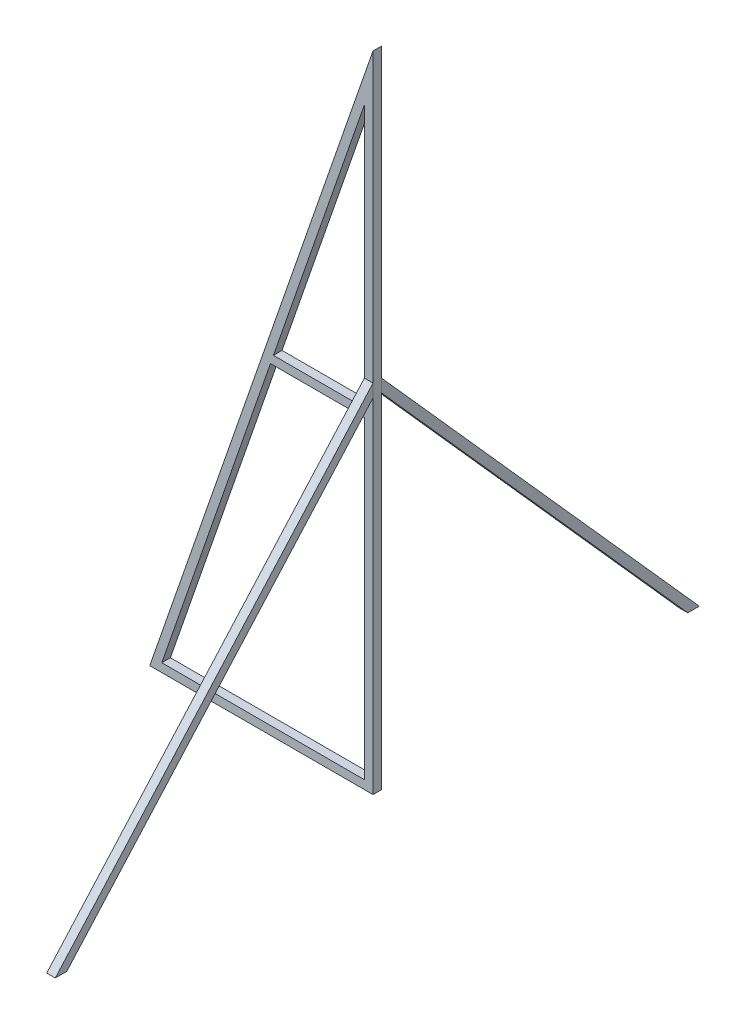
ISO-10303-21;
HEADER;
FILE_DESCRIPTION(('STEP AP214'),'2;1');
FILE_NAME('part.step','',(''),(''),'','','');
FILE_SCHEMA(('AUTOMOTIVE_DESIGN { 1 0 10303 214 1 1 1 1 }'));
ENDSEC;
DATA;
#1=APPLICATION_CONTEXT('core data for automotive mechanical design processes');
#2=APPLICATION_PROTOCOL_DEFINITION('international standard','automotive_design',2000,#1);
#3=PRODUCT_CONTEXT('',#1,'mechanical');
#4=PRODUCT('Part','Part','',(#3));
#5=PRODUCT_RELATED_PRODUCT_CATEGORY('part','',(#4));
#6=PRODUCT_DEFINITION_FORMATION('','',#4);
#7=PRODUCT_DEFINITION_CONTEXT('part definition',#1,'design');
#8=PRODUCT_DEFINITION('design','',#6,#7);
#9=PRODUCT_DEFINITION_SHAPE('','',#8);
#10=(LENGTH_UNIT() NAMED_UNIT(*) SI_UNIT(.MILLI.,.METRE.));
#11=(NAMED_UNIT(*) PLANE_ANGLE_UNIT() SI_UNIT($,.RADIAN.));
#12=(NAMED_UNIT(*) SI_UNIT($,.STERADIAN.) SOLID_ANGLE_UNIT());
#13=UNCERTAINTY_MEASURE_WITH_UNIT(LENGTH_MEASURE(1.E-05),#10,'distance_accuracy_value','');
#14=(GEOMETRIC_REPRESENTATION_CONTEXT(3) GLOBAL_UNCERTAINTY_ASSIGNED_CONTEXT((#13)) GLOBAL_UNIT_ASSIGNED_CONTEXT((#10,
#11,#12)) REPRESENTATION_CONTEXT('',''));
#15=CARTESIAN_POINT('',(0.,0.,0.));
#16=DIRECTION('',(0.,0.,1.));
#17=DIRECTION('',(1.,0.,0.));
#18=AXIS2_PLACEMENT_3D('',#15,#16,#17);
#19=CARTESIAN_POINT('',(50.,83.0054621254937,0.));
#20=DIRECTION('',(0.,0.665455066971264,-0.746437910239204));
#21=DIRECTION('',(0.,0.746437910239204,0.665455066971264));
#22=AXIS2_PLACEMENT_3D('',#19,#20,#21);
#23=PLANE('',#22);
#24=DIRECTION('',(0.,0.746437910239204,0.665455066971264));
#25=VECTOR('',#24,1.);
#26=CARTESIAN_POINT('',(52.,83.0054621254937,0.));
#27=LINE('',#26,#25);
#28=CARTESIAN_POINT('',(52.,0.,-74.));
#29=VERTEX_POINT('',#28);
#30=CARTESIAN_POINT('',(52.,83.0054621254937,0.));
#31=VERTEX_POINT('',#30);
#32=EDGE_CURVE('E113',#29,#31,#27,.T.);
#33=ORIENTED_EDGE('',*,*,#32,.F.);
#34=DIRECTION('',(1.,0.,0.));
#35=VECTOR('',#34,1.);
#36=CARTESIAN_POINT('',(50.,0.,-74.));
#37=LINE('',#36,#35);
#38=CARTESIAN_POINT('',(50.,0.,-74.));
#39=VERTEX_POINT('',#38);
#40=EDGE_CURVE('E12',#39,#29,#37,.T.);
#41=ORIENTED_EDGE('',*,*,#40,.F.);
#42=DIRECTION('',(0.,0.746437910239204,0.665455066971264));
#43=VECTOR('',#42,1.);
#44=CARTESIAN_POINT('',(50.,83.0054621254937,0.));
#45=LINE('',#44,#43);
#46=CARTESIAN_POINT('',(50.,83.0054621254937,0.));
#47=VERTEX_POINT('',#46);
#48=EDGE_CURVE('E107',#39,#47,#45,.T.);
#49=ORIENTED_EDGE('',*,*,#48,.T.);
#50=DIRECTION('',(1.,0.,0.));
#51=VECTOR('',#50,1.);
#52=CARTESIAN_POINT('',(50.,83.0054621254937,0.));
#53=LINE('',#52,#51);
#54=EDGE_CURVE('E52',#47,#31,#53,.T.);
#55=ORIENTED_EDGE('',*,*,#54,.T.);
#56=EDGE_LOOP('',(#33,#41,#49,#55));
#57=FACE_BOUND('',#56,.T.);
#58=ADVANCED_FACE('F49',(#57),#23,.T.);
#59=CARTESIAN_POINT('',(50.,0.,-74.));
#60=DIRECTION('',(0.,-1.,0.));
#61=DIRECTION('',(0.,0.,-1.));
#62=AXIS2_PLACEMENT_3D('',#59,#60,#61);
#63=PLANE('',#62);
#64=DIRECTION('',(0.,0.,-1.));
#65=VECTOR('',#64,1.);
#66=CARTESIAN_POINT('',(52.,0.,-74.));
#67=LINE('',#66,#65);
#68=CARTESIAN_POINT('',(52.,0.,-71.3206076854281));
#69=VERTEX_POINT('',#68);
#70=EDGE_CURVE('E109',#69,#29,#67,.T.);
#71=ORIENTED_EDGE('',*,*,#70,.F.);
#72=DIRECTION('',(1.,0.,0.));
#73=VECTOR('',#72,1.);
#74=CARTESIAN_POINT('',(50.,0.,-71.3206076854281));
#75=LINE('',#74,#73);
#76=CARTESIAN_POINT('',(50.,0.,-71.3206076854281));
#77=VERTEX_POINT('',#76);
#78=EDGE_CURVE('E58',#77,#69,#75,.T.);
#79=ORIENTED_EDGE('',*,*,#78,.F.);
#80=DIRECTION('',(0.,0.,-1.));
#81=VECTOR('',#80,1.);
#82=CARTESIAN_POINT('',(50.,0.,-74.));
#83=LINE('',#82,#81);
#84=EDGE_CURVE('E104',#77,#39,#83,.T.);
#85=ORIENTED_EDGE('',*,*,#84,.T.);
#86=ORIENTED_EDGE('',*,*,#40,.T.);
#87=EDGE_LOOP('',(#71,#79,#85,#86));
#88=FACE_BOUND('',#87,.T.);
#89=ADVANCED_FACE('F123',(#88),#63,.T.);
#90=CARTESIAN_POINT('',(50.,0.,-71.3206076854281));
#91=DIRECTION('',(0.,-0.665455066971264,0.746437910239204));
#92=DIRECTION('',(0.,-0.746437910239204,-0.665455066971264));
#93=AXIS2_PLACEMENT_3D('',#90,#91,#92);
#94=PLANE('',#93);
#95=DIRECTION('',(0.,-0.746437910239204,-0.665455066971264));
#96=VECTOR('',#95,1.);
#97=CARTESIAN_POINT('',(52.,0.,-71.3206076854281));
#98=LINE('',#97,#96);
#99=CARTESIAN_POINT('',(52.,80.,0.));
#100=VERTEX_POINT('',#99);
#101=EDGE_CURVE('E99',#100,#69,#98,.T.);
#102=ORIENTED_EDGE('',*,*,#101,.F.);
#103=DIRECTION('',(1.,0.,0.));
#104=VECTOR('',#103,1.);
#105=CARTESIAN_POINT('',(50.,80.,0.));
#106=LINE('',#105,#104);
#107=CARTESIAN_POINT('',(50.,80.,0.));
#108=VERTEX_POINT('',#107);
#109=EDGE_CURVE('E94',#108,#100,#106,.T.);
#110=ORIENTED_EDGE('',*,*,#109,.F.);
#111=DIRECTION('',(0.,-0.746437910239204,-0.665455066971264));
#112=VECTOR('',#111,1.);
#113=CARTESIAN_POINT('',(50.,0.,-71.3206076854281));
#114=LINE('',#113,#112);
#115=EDGE_CURVE('E97',#108,#77,#114,.T.);
#116=ORIENTED_EDGE('',*,*,#115,.T.);
#117=ORIENTED_EDGE('',*,*,#78,.T.);
#118=EDGE_LOOP('',(#102,#110,#116,#117));
#119=FACE_BOUND('',#118,.T.);
#120=ADVANCED_FACE('F96',(#119),#94,.T.);
#121=CARTESIAN_POINT('',(50.,80.,0.));
#122=DIRECTION('',(0.,0.,1.));
#123=DIRECTION('',(0.,-1.,0.));
#124=AXIS2_PLACEMENT_3D('',#121,#122,#123);
#125=PLANE('',#124);
#126=DIRECTION('',(0.,-1.,0.));
#127=VECTOR('',#126,1.);
#128=CARTESIAN_POINT('',(52.,80.,0.));
#129=LINE('',#128,#127);
#130=EDGE_CURVE('E116',#31,#100,#129,.T.);
#131=ORIENTED_EDGE('',*,*,#130,.F.);
#132=ORIENTED_EDGE('',*,*,#54,.F.);
#133=DIRECTION('',(0.,-1.,0.));
#134=VECTOR('',#133,1.);
#135=CARTESIAN_POINT('',(50.,80.,0.));
#136=LINE('',#135,#134);
#137=EDGE_CURVE('E103',#47,#108,#136,.T.);
#138=ORIENTED_EDGE('',*,*,#137,.T.);
#139=ORIENTED_EDGE('',*,*,#109,.T.);
#140=EDGE_LOOP('',(#131,#132,#138,#139));
#141=FACE_BOUND('',#140,.T.);
#142=ADVANCED_FACE('F106',(#141),#125,.T.);
#143=CARTESIAN_POINT('',(50.,0.,0.));
#144=DIRECTION('',(-1.,0.,0.));
#145=DIRECTION('',(0.,0.,1.));
#146=AXIS2_PLACEMENT_3D('',#143,#144,#145);
#147=PLANE('',#146);
#148=ORIENTED_EDGE('',*,*,#48,.F.);
#149=ORIENTED_EDGE('',*,*,#84,.F.);
#150=ORIENTED_EDGE('',*,*,#115,.F.);
#151=ORIENTED_EDGE('',*,*,#137,.F.);
#152=EDGE_LOOP('',(#148,#149,#150,#151));
#153=FACE_BOUND('',#152,.T.);
#154=ADVANCED_FACE('F102',(#153),#147,.T.);
#155=CARTESIAN_POINT('',(52.,0.,0.));
#156=DIRECTION('',(-1.,0.,0.));
#157=DIRECTION('',(0.,0.,1.));
#158=AXIS2_PLACEMENT_3D('',#155,#156,#157);
#159=PLANE('',#158);
#160=ORIENTED_EDGE('',*,*,#32,.T.);
#161=ORIENTED_EDGE('',*,*,#130,.T.);
#162=ORIENTED_EDGE('',*,*,#101,.T.);
#163=ORIENTED_EDGE('',*,*,#70,.T.);
#164=EDGE_LOOP('',(#160,#161,#162,#163));
#165=FACE_BOUND('',#164,.T.);
#166=ADVANCED_FACE('F122',(#165),#159,.F.);
#167=CLOSED_SHELL('',(#58,#89,#120,#142,#154,#166));
#168=MANIFOLD_SOLID_BREP('B2',#167);
#169=CARTESIAN_POINT('',(50.,80.,2.));
#170=DIRECTION('',(0.,0.,-1.));
#171=DIRECTION('',(0.,1.,0.));
#172=AXIS2_PLACEMENT_3D('',#169,#170,#171);
#173=PLANE('',#172);
#174=DIRECTION('',(0.,1.,0.));
#175=VECTOR('',#174,1.);
#176=CARTESIAN_POINT('',(52.,80.,2.));
#177=LINE('',#176,#175);
#178=CARTESIAN_POINT('',(52.,80.,2.));
#179=VERTEX_POINT('',#178);
#180=CARTESIAN_POINT('',(52.,83.0054621254937,2.));
#181=VERTEX_POINT('',#180);
#182=EDGE_CURVE('E245',#179,#181,#177,.T.);
#183=ORIENTED_EDGE('',*,*,#182,.F.);
#184=DIRECTION('',(1.,0.,0.));
#185=VECTOR('',#184,1.);
#186=CARTESIAN_POINT('',(50.,80.,2.));
#187=LINE('',#186,#185);
#188=CARTESIAN_POINT('',(50.,80.,2.));
#189=VERTEX_POINT('',#188);
#190=EDGE_CURVE('E47',#189,#179,#187,.T.);
#191=ORIENTED_EDGE('',*,*,#190,.F.);
#192=DIRECTION('',(0.,1.,0.));
#193=VECTOR('',#192,1.);
#194=CARTESIAN_POINT('',(50.,80.,2.));
#195=LINE('',#194,#193);
#196=CARTESIAN_POINT('',(50.,83.0054621254937,2.));
#197=VERTEX_POINT('',#196);
#198=EDGE_CURVE('E239',#189,#197,#195,.T.);
#199=ORIENTED_EDGE('',*,*,#198,.T.);
#200=DIRECTION('',(1.,0.,0.));
#201=VECTOR('',#200,1.);
#202=CARTESIAN_POINT('',(50.,83.0054621254937,2.));
#203=LINE('',#202,#201);
#204=EDGE_CURVE('E184',#197,#181,#203,.T.);
#205=ORIENTED_EDGE('',*,*,#204,.T.);
#206=EDGE_LOOP('',(#183,#191,#199,#205));
#207=FACE_BOUND('',#206,.T.);
#208=ADVANCED_FACE('F181',(#207),#173,.T.);
#209=CARTESIAN_POINT('',(50.,0.,73.3206076854281));
#210=DIRECTION('',(0.,-0.665455066971264,-0.746437910239204));
#211=DIRECTION('',(0.,0.746437910239204,-0.665455066971264));
#212=AXIS2_PLACEMENT_3D('',#209,#210,#211);
#213=PLANE('',#212);
#214=DIRECTION('',(0.,0.746437910239204,-0.665455066971264));
#215=VECTOR('',#214,1.);
#216=CARTESIAN_POINT('',(52.,0.,73.3206076854281));
#217=LINE('',#216,#215);
#218=CARTESIAN_POINT('',(52.,0.,73.3206076854281));
#219=VERTEX_POINT('',#218);
#220=EDGE_CURVE('E241',#219,#179,#217,.T.);
#221=ORIENTED_EDGE('',*,*,#220,.F.);
#222=DIRECTION('',(1.,0.,0.));
#223=VECTOR('',#222,1.);
#224=CARTESIAN_POINT('',(50.,0.,73.3206076854281));
#225=LINE('',#224,#223);
#226=CARTESIAN_POINT('',(50.,0.,73.3206076854281));
#227=VERTEX_POINT('',#226);
#228=EDGE_CURVE('E190',#227,#219,#225,.T.);
#229=ORIENTED_EDGE('',*,*,#228,.F.);
#230=DIRECTION('',(0.,0.746437910239204,-0.665455066971264));
#231=VECTOR('',#230,1.);
#232=CARTESIAN_POINT('',(50.,0.,73.3206076854281));
#233=LINE('',#232,#231);
#234=EDGE_CURVE('E236',#227,#189,#233,.T.);
#235=ORIENTED_EDGE('',*,*,#234,.T.);
#236=ORIENTED_EDGE('',*,*,#190,.T.);
#237=EDGE_LOOP('',(#221,#229,#235,#236));
#238=FACE_BOUND('',#237,.T.);
#239=ADVANCED_FACE('F255',(#238),#213,.T.);
#240=CARTESIAN_POINT('',(50.,0.,76.));
#241=DIRECTION('',(0.,-1.,0.));
#242=DIRECTION('',(0.,0.,-1.));
#243=AXIS2_PLACEMENT_3D('',#240,#241,#242);
#244=PLANE('',#243);
#245=DIRECTION('',(0.,0.,-1.));
#246=VECTOR('',#245,1.);
#247=CARTESIAN_POINT('',(52.,0.,76.));
#248=LINE('',#247,#246);
#249=CARTESIAN_POINT('',(52.,0.,76.));
#250=VERTEX_POINT('',#249);
#251=EDGE_CURVE('E231',#250,#219,#248,.T.);
#252=ORIENTED_EDGE('',*,*,#251,.F.);
#253=DIRECTION('',(1.,0.,0.));
#254=VECTOR('',#253,1.);
#255=CARTESIAN_POINT('',(50.,0.,76.));
#256=LINE('',#255,#254);
#257=CARTESIAN_POINT('',(50.,0.,76.));
#258=VERTEX_POINT('',#257);
#259=EDGE_CURVE('E226',#258,#250,#256,.T.);
#260=ORIENTED_EDGE('',*,*,#259,.F.);
#261=DIRECTION('',(0.,0.,-1.));
#262=VECTOR('',#261,1.);
#263=CARTESIAN_POINT('',(50.,0.,76.));
#264=LINE('',#263,#262);
#265=EDGE_CURVE('E229',#258,#227,#264,.T.);
#266=ORIENTED_EDGE('',*,*,#265,.T.);
#267=ORIENTED_EDGE('',*,*,#228,.T.);
#268=EDGE_LOOP('',(#252,#260,#266,#267));
#269=FACE_BOUND('',#268,.T.);
#270=ADVANCED_FACE('F228',(#269),#244,.T.);
#271=CARTESIAN_POINT('',(50.,83.0054621254937,2.));
#272=DIRECTION('',(0.,0.665455066971264,0.746437910239204));
#273=DIRECTION('',(0.,-0.746437910239204,0.665455066971264));
#274=AXIS2_PLACEMENT_3D('',#271,#272,#273);
#275=PLANE('',#274);
#276=DIRECTION('',(0.,-0.746437910239204,0.665455066971264));
#277=VECTOR('',#276,1.);
#278=CARTESIAN_POINT('',(52.,83.0054621254937,2.));
#279=LINE('',#278,#277);
#280=EDGE_CURVE('E248',#181,#250,#279,.T.);
#281=ORIENTED_EDGE('',*,*,#280,.F.);
#282=ORIENTED_EDGE('',*,*,#204,.F.);
#283=DIRECTION('',(0.,-0.746437910239204,0.665455066971264));
#284=VECTOR('',#283,1.);
#285=CARTESIAN_POINT('',(50.,83.0054621254937,2.));
#286=LINE('',#285,#284);
#287=EDGE_CURVE('E235',#197,#258,#286,.T.);
#288=ORIENTED_EDGE('',*,*,#287,.T.);
#289=ORIENTED_EDGE('',*,*,#259,.T.);
#290=EDGE_LOOP('',(#281,#282,#288,#289));
#291=FACE_BOUND('',#290,.T.);
#292=ADVANCED_FACE('F238',(#291),#275,.T.);
#293=CARTESIAN_POINT('',(50.,0.,0.));
#294=DIRECTION('',(-1.,0.,0.));
#295=DIRECTION('',(0.,0.,1.));
#296=AXIS2_PLACEMENT_3D('',#293,#294,#295);
#297=PLANE('',#296);
#298=ORIENTED_EDGE('',*,*,#198,.F.);
#299=ORIENTED_EDGE('',*,*,#234,.F.);
#300=ORIENTED_EDGE('',*,*,#265,.F.);
#301=ORIENTED_EDGE('',*,*,#287,.F.);
#302=EDGE_LOOP('',(#298,#299,#300,#301));
#303=FACE_BOUND('',#302,.T.);
#304=ADVANCED_FACE('F234',(#303),#297,.T.);
#305=CARTESIAN_POINT('',(52.,0.,0.));
#306=DIRECTION('',(-1.,0.,0.));
#307=DIRECTION('',(0.,0.,1.));
#308=AXIS2_PLACEMENT_3D('',#305,#306,#307);
#309=PLANE('',#308);
#310=ORIENTED_EDGE('',*,*,#182,.T.);
#311=ORIENTED_EDGE('',*,*,#280,.T.);
#312=ORIENTED_EDGE('',*,*,#251,.T.);
#313=ORIENTED_EDGE('',*,*,#220,.T.);
#314=EDGE_LOOP('',(#310,#311,#312,#313));
#315=FACE_BOUND('',#314,.T.);
#316=ADVANCED_FACE('F254',(#315),#309,.F.);
#317=CLOSED_SHELL('',(#208,#239,#270,#292,#304,#316));
#318=MANIFOLD_SOLID_BREP('B6',#317);
#319=CARTESIAN_POINT('',(52.,0.,2.));
#320=DIRECTION('',(-1.,0.,0.));
#321=DIRECTION('',(0.,0.,1.));
#322=AXIS2_PLACEMENT_3D('',#319,#320,#321);
#323=PLANE('',#322);
#324=DIRECTION('',(0.,1.,0.));
#325=VECTOR('',#324,1.);
#326=CARTESIAN_POINT('',(52.,0.,0.));
#327=LINE('',#326,#325);
#328=CARTESIAN_POINT('',(52.,0.,0.));
#329=VERTEX_POINT('',#328);
#330=CARTESIAN_POINT('',(52.,150.,0.));
#331=VERTEX_POINT('',#330);
#332=EDGE_CURVE('E401',#329,#331,#327,.T.);
#333=ORIENTED_EDGE('',*,*,#332,.T.);
#334=DIRECTION('',(0.,0.,-1.));
#335=VECTOR('',#334,1.);
#336=CARTESIAN_POINT('',(52.,150.,2.));
#337=LINE('',#336,#335);
#338=CARTESIAN_POINT('',(52.,150.,2.));
#339=VERTEX_POINT('',#338);
#340=EDGE_CURVE('E179',#339,#331,#337,.T.);
#341=ORIENTED_EDGE('',*,*,#340,.F.);
#342=DIRECTION('',(0.,1.,0.));
#343=VECTOR('',#342,1.);
#344=CARTESIAN_POINT('',(52.,0.,2.));
#345=LINE('',#344,#343);
#346=CARTESIAN_POINT('',(52.,0.,2.));
#347=VERTEX_POINT('',#346);
#348=EDGE_CURVE('E393',#347,#339,#345,.T.);
#349=ORIENTED_EDGE('',*,*,#348,.F.);
#350=DIRECTION('',(0.,0.,-1.));
#351=VECTOR('',#350,1.);
#352=CARTESIAN_POINT('',(52.,0.,2.));
#353=LINE('',#352,#351);
#354=EDGE_CURVE('E402',#347,#329,#353,.T.);
#355=ORIENTED_EDGE('',*,*,#354,.T.);
#356=EDGE_LOOP('',(#333,#341,#349,#355));
#357=FACE_BOUND('',#356,.T.);
#358=ADVANCED_FACE('F304',(#357),#323,.F.);
#359=CARTESIAN_POINT('',(0.,0.,2.));
#360=DIRECTION('',(0.944836198498626,-0.327543215479524,0.));
#361=DIRECTION('',(0.327543215479524,0.944836198498626,0.));
#362=AXIS2_PLACEMENT_3D('',#359,#360,#361);
#363=PLANE('',#362);
#364=DIRECTION('',(-0.327543215479524,-0.944836198498626,0.));
#365=VECTOR('',#364,1.);
#366=CARTESIAN_POINT('',(0.,0.,0.));
#367=LINE('',#366,#365);
#368=CARTESIAN_POINT('',(0.,0.,0.));
#369=VERTEX_POINT('',#368);
#370=EDGE_CURVE('E356',#331,#369,#367,.T.);
#371=ORIENTED_EDGE('',*,*,#370,.T.);
#372=DIRECTION('',(0.,0.,-1.));
#373=VECTOR('',#372,1.);
#374=CARTESIAN_POINT('',(0.,0.,2.));
#375=LINE('',#374,#373);
#376=CARTESIAN_POINT('',(0.,0.,2.));
#377=VERTEX_POINT('',#376);
#378=EDGE_CURVE('E314',#377,#369,#375,.T.);
#379=ORIENTED_EDGE('',*,*,#378,.F.);
#380=DIRECTION('',(-0.327543215479524,-0.944836198498626,0.));
#381=VECTOR('',#380,1.);
#382=CARTESIAN_POINT('',(0.,0.,2.));
#383=LINE('',#382,#381);
#384=EDGE_CURVE('E389',#339,#377,#383,.T.);
#385=ORIENTED_EDGE('',*,*,#384,.F.);
#386=ORIENTED_EDGE('',*,*,#340,.T.);
#387=EDGE_LOOP('',(#371,#379,#385,#386));
#388=FACE_BOUND('',#387,.T.);
#389=ADVANCED_FACE('F390',(#388),#363,.F.);
#390=CARTESIAN_POINT('',(50.,0.,2.));
#391=DIRECTION('',(-1.,0.,0.));
#392=DIRECTION('',(0.,0.,1.));
#393=AXIS2_PLACEMENT_3D('',#390,#391,#392);
#394=PLANE('',#393);
#395=DIRECTION('',(0.,1.,0.));
#396=VECTOR('',#395,1.);
#397=CARTESIAN_POINT('',(50.,0.,0.));
#398=LINE('',#397,#396);
#399=CARTESIAN_POINT('',(50.,2.,0.));
#400=VERTEX_POINT('',#399);
#401=CARTESIAN_POINT('',(50.,75.,0.));
#402=VERTEX_POINT('',#401);
#403=EDGE_CURVE('E442',#400,#402,#398,.T.);
#404=ORIENTED_EDGE('',*,*,#403,.F.);
#405=DIRECTION('',(0.,0.,-1.));
#406=VECTOR('',#405,1.);
#407=CARTESIAN_POINT('',(50.,2.,2.));
#408=LINE('',#407,#406);
#409=CARTESIAN_POINT('',(50.,2.,2.));
#410=VERTEX_POINT('',#409);
#411=EDGE_CURVE('E415',#410,#400,#408,.T.);
#412=ORIENTED_EDGE('',*,*,#411,.F.);
#413=DIRECTION('',(0.,1.,0.));
#414=VECTOR('',#413,1.);
#415=CARTESIAN_POINT('',(50.,0.,2.));
#416=LINE('',#415,#414);
#417=CARTESIAN_POINT('',(50.,75.,2.));
#418=VERTEX_POINT('',#417);
#419=EDGE_CURVE('E462',#410,#418,#416,.T.);
#420=ORIENTED_EDGE('',*,*,#419,.T.);
#421=DIRECTION('',(0.,0.,-1.));
#422=VECTOR('',#421,1.);
#423=CARTESIAN_POINT('',(50.,75.,2.));
#424=LINE('',#423,#422);
#425=EDGE_CURVE('E417',#418,#402,#424,.T.);
#426=ORIENTED_EDGE('',*,*,#425,.T.);
#427=EDGE_LOOP('',(#404,#412,#420,#426));
#428=FACE_BOUND('',#427,.T.);
#429=ADVANCED_FACE('F458',(#428),#394,.T.);
#430=CARTESIAN_POINT('',(0.,2.,2.));
#431=DIRECTION('',(0.,1.,0.));
#432=DIRECTION('',(0.,0.,1.));
#433=AXIS2_PLACEMENT_3D('',#430,#431,#432);
#434=PLANE('',#433);
#435=DIRECTION('',(1.,0.,0.));
#436=VECTOR('',#435,1.);
#437=CARTESIAN_POINT('',(0.,2.,0.));
#438=LINE('',#437,#436);
#439=CARTESIAN_POINT('',(2.8101023597297,2.,0.));
#440=VERTEX_POINT('',#439);
#441=EDGE_CURVE('E449',#440,#400,#438,.T.);
#442=ORIENTED_EDGE('',*,*,#441,.F.);
#443=DIRECTION('',(0.,0.,-1.));
#444=VECTOR('',#443,1.);
#445=CARTESIAN_POINT('',(2.8101023597297,2.,2.));
#446=LINE('',#445,#444);
#447=CARTESIAN_POINT('',(2.8101023597297,2.,2.));
#448=VERTEX_POINT('',#447);
#449=EDGE_CURVE('E421',#448,#440,#446,.T.);
#450=ORIENTED_EDGE('',*,*,#449,.F.);
#451=DIRECTION('',(1.,0.,0.));
#452=VECTOR('',#451,1.);
#453=CARTESIAN_POINT('',(0.,2.,2.));
#454=LINE('',#453,#452);
#455=EDGE_CURVE('E475',#448,#410,#454,.T.);
#456=ORIENTED_EDGE('',*,*,#455,.T.);
#457=ORIENTED_EDGE('',*,*,#411,.T.);
#458=EDGE_LOOP('',(#442,#450,#456,#457));
#459=FACE_BOUND('',#458,.T.);
#460=ADVANCED_FACE('F474',(#459),#434,.T.);
#461=CARTESIAN_POINT('',(1.88967239699723,-0.655086430959041,2.));
#462=DIRECTION('',(0.944836198498626,-0.327543215479524,0.));
#463=DIRECTION('',(0.327543215479524,0.944836198498626,0.));
#464=AXIS2_PLACEMENT_3D('',#461,#462,#463);
#465=PLANE('',#464);
#466=DIRECTION('',(-0.327543215479524,-0.944836198498626,0.));
#467=VECTOR('',#466,1.);
#468=CARTESIAN_POINT('',(1.88967239699723,-0.655086430959041,0.));
#469=LINE('',#468,#467);
#470=CARTESIAN_POINT('',(28.1167690263964,75.,0.));
#471=VERTEX_POINT('',#470);
#472=EDGE_CURVE('E408',#471,#440,#469,.T.);
#473=ORIENTED_EDGE('',*,*,#472,.F.);
#474=DIRECTION('',(0.,0.,-1.));
#475=VECTOR('',#474,1.);
#476=CARTESIAN_POINT('',(28.1167690263964,75.,2.));
#477=LINE('',#476,#475);
#478=CARTESIAN_POINT('',(28.1167690263964,75.,2.));
#479=VERTEX_POINT('',#478);
#480=EDGE_CURVE('E419',#479,#471,#477,.T.);
#481=ORIENTED_EDGE('',*,*,#480,.F.);
#482=DIRECTION('',(-0.327543215479524,-0.944836198498626,0.));
#483=VECTOR('',#482,1.);
#484=CARTESIAN_POINT('',(1.88967239699723,-0.655086430959041,2.));
#485=LINE('',#484,#483);
#486=EDGE_CURVE('E470',#479,#448,#485,.T.);
#487=ORIENTED_EDGE('',*,*,#486,.T.);
#488=ORIENTED_EDGE('',*,*,#449,.T.);
#489=EDGE_LOOP('',(#473,#481,#487,#488));
#490=FACE_BOUND('',#489,.T.);
#491=ADVANCED_FACE('F469',(#490),#465,.T.);
#492=CARTESIAN_POINT('',(50.,77.,0.));
#493=VERTEX_POINT('',#492);
#494=CARTESIAN_POINT('',(50.,138.124704731549,0.));
#495=VERTEX_POINT('',#494);
#496=EDGE_CURVE('E438',#493,#495,#398,.T.);
#497=ORIENTED_EDGE('',*,*,#496,.F.);
#498=DIRECTION('',(0.,0.,-1.));
#499=VECTOR('',#498,1.);
#500=CARTESIAN_POINT('',(50.,77.,2.));
#501=LINE('',#500,#499);
#502=CARTESIAN_POINT('',(50.,77.,2.));
#503=VERTEX_POINT('',#502);
#504=EDGE_CURVE('E308',#503,#493,#501,.T.);
#505=ORIENTED_EDGE('',*,*,#504,.F.);
#506=CARTESIAN_POINT('',(50.,138.124704731549,2.));
#507=VERTEX_POINT('',#506);
#508=EDGE_CURVE('E413',#503,#507,#416,.T.);
#509=ORIENTED_EDGE('',*,*,#508,.T.);
#510=DIRECTION('',(0.,0.,-1.));
#511=VECTOR('',#510,1.);
#512=CARTESIAN_POINT('',(50.,138.124704731549,2.));
#513=LINE('',#512,#511);
#514=EDGE_CURVE('E424',#507,#495,#513,.T.);
#515=ORIENTED_EDGE('',*,*,#514,.T.);
#516=EDGE_LOOP('',(#497,#505,#509,#515));
#517=FACE_BOUND('',#516,.T.);
#518=ADVANCED_FACE('F439',(#517),#394,.T.);
#519=CARTESIAN_POINT('',(0.,77.,2.));
#520=DIRECTION('',(0.,1.,0.));
#521=DIRECTION('',(0.,0.,1.));
#522=AXIS2_PLACEMENT_3D('',#519,#520,#521);
#523=PLANE('',#522);
#524=DIRECTION('',(1.,0.,0.));
#525=VECTOR('',#524,1.);
#526=CARTESIAN_POINT('',(0.,77.,0.));
#527=LINE('',#526,#525);
#528=CARTESIAN_POINT('',(28.8101023597297,77.,0.));
#529=VERTEX_POINT('',#528);
#530=EDGE_CURVE('E433',#529,#493,#527,.T.);
#531=ORIENTED_EDGE('',*,*,#530,.F.);
#532=DIRECTION('',(0.,0.,-1.));
#533=VECTOR('',#532,1.);
#534=CARTESIAN_POINT('',(28.8101023597297,77.,2.));
#535=LINE('',#534,#533);
#536=CARTESIAN_POINT('',(28.8101023597297,77.,2.));
#537=VERTEX_POINT('',#536);
#538=EDGE_CURVE('E425',#537,#529,#535,.T.);
#539=ORIENTED_EDGE('',*,*,#538,.F.);
#540=DIRECTION('',(1.,0.,0.));
#541=VECTOR('',#540,1.);
#542=CARTESIAN_POINT('',(0.,77.,2.));
#543=LINE('',#542,#541);
#544=EDGE_CURVE('E436',#537,#503,#543,.T.);
#545=ORIENTED_EDGE('',*,*,#544,.T.);
#546=ORIENTED_EDGE('',*,*,#504,.T.);
#547=EDGE_LOOP('',(#531,#539,#545,#546));
#548=FACE_BOUND('',#547,.T.);
#549=ADVANCED_FACE('F306',(#548),#523,.T.);
#550=CARTESIAN_POINT('',(0.,75.,2.));
#551=DIRECTION('',(0.,1.,0.));
#552=DIRECTION('',(0.,0.,1.));
#553=AXIS2_PLACEMENT_3D('',#550,#551,#552);
#554=PLANE('',#553);
#555=DIRECTION('',(1.,0.,0.));
#556=VECTOR('',#555,1.);
#557=CARTESIAN_POINT('',(0.,75.,0.));
#558=LINE('',#557,#556);
#559=EDGE_CURVE('E404',#471,#402,#558,.T.);
#560=ORIENTED_EDGE('',*,*,#559,.T.);
#561=ORIENTED_EDGE('',*,*,#425,.F.);
#562=DIRECTION('',(1.,0.,0.));
#563=VECTOR('',#562,1.);
#564=CARTESIAN_POINT('',(0.,75.,2.));
#565=LINE('',#564,#563);
#566=EDGE_CURVE('E398',#479,#418,#565,.T.);
#567=ORIENTED_EDGE('',*,*,#566,.F.);
#568=ORIENTED_EDGE('',*,*,#480,.T.);
#569=EDGE_LOOP('',(#560,#561,#567,#568));
#570=FACE_BOUND('',#569,.T.);
#571=ADVANCED_FACE('F465',(#570),#554,.F.);
#572=EDGE_CURVE('E445',#495,#529,#469,.T.);
#573=ORIENTED_EDGE('',*,*,#572,.F.);
#574=ORIENTED_EDGE('',*,*,#514,.F.);
#575=EDGE_CURVE('E479',#507,#537,#485,.T.);
#576=ORIENTED_EDGE('',*,*,#575,.T.);
#577=ORIENTED_EDGE('',*,*,#538,.T.);
#578=EDGE_LOOP('',(#573,#574,#576,#577));
#579=FACE_BOUND('',#578,.T.);
#580=ADVANCED_FACE('F492',(#579),#465,.T.);
#581=CARTESIAN_POINT('',(0.,0.,2.));
#582=DIRECTION('',(0.,1.,0.));
#583=DIRECTION('',(0.,0.,1.));
#584=AXIS2_PLACEMENT_3D('',#581,#582,#583);
#585=PLANE('',#584);
#586=DIRECTION('',(1.,0.,0.));
#587=VECTOR('',#586,1.);
#588=CARTESIAN_POINT('',(0.,0.,0.));
#589=LINE('',#588,#587);
#590=EDGE_CURVE('E362',#369,#329,#589,.T.);
#591=ORIENTED_EDGE('',*,*,#590,.T.);
#592=ORIENTED_EDGE('',*,*,#354,.F.);
#593=DIRECTION('',(1.,0.,0.));
#594=VECTOR('',#593,1.);
#595=CARTESIAN_POINT('',(0.,0.,2.));
#596=LINE('',#595,#594);
#597=EDGE_CURVE('E323',#377,#347,#596,.T.);
#598=ORIENTED_EDGE('',*,*,#597,.F.);
#599=ORIENTED_EDGE('',*,*,#378,.T.);
#600=EDGE_LOOP('',(#591,#592,#598,#599));
#601=FACE_BOUND('',#600,.T.);
#602=ADVANCED_FACE('F484',(#601),#585,.F.);
#603=CARTESIAN_POINT('',(0.,0.,2.));
#604=DIRECTION('',(0.,0.,1.));
#605=DIRECTION('',(1.,0.,0.));
#606=AXIS2_PLACEMENT_3D('',#603,#604,#605);
#607=PLANE('',#606);
#608=ORIENTED_EDGE('',*,*,#508,.F.);
#609=ORIENTED_EDGE('',*,*,#544,.F.);
#610=ORIENTED_EDGE('',*,*,#575,.F.);
#611=EDGE_LOOP('',(#608,#609,#610));
#612=FACE_BOUND('',#611,.T.);
#613=ORIENTED_EDGE('',*,*,#419,.F.);
#614=ORIENTED_EDGE('',*,*,#455,.F.);
#615=ORIENTED_EDGE('',*,*,#486,.F.);
#616=ORIENTED_EDGE('',*,*,#566,.T.);
#617=EDGE_LOOP('',(#613,#614,#615,#616));
#618=FACE_BOUND('',#617,.T.);
#619=ORIENTED_EDGE('',*,*,#348,.T.);
#620=ORIENTED_EDGE('',*,*,#384,.T.);
#621=ORIENTED_EDGE('',*,*,#597,.T.);
#622=EDGE_LOOP('',(#619,#620,#621));
#623=FACE_BOUND('',#622,.T.);
#624=ADVANCED_FACE('F396',(#612,#618,#623),#607,.T.);
#625=CARTESIAN_POINT('',(0.,0.,0.));
#626=DIRECTION('',(0.,0.,1.));
#627=DIRECTION('',(1.,0.,0.));
#628=AXIS2_PLACEMENT_3D('',#625,#626,#627);
#629=PLANE('',#628);
#630=ORIENTED_EDGE('',*,*,#496,.T.);
#631=ORIENTED_EDGE('',*,*,#572,.T.);
#632=ORIENTED_EDGE('',*,*,#530,.T.);
#633=EDGE_LOOP('',(#630,#631,#632));
#634=FACE_BOUND('',#633,.T.);
#635=ORIENTED_EDGE('',*,*,#403,.T.);
#636=ORIENTED_EDGE('',*,*,#559,.F.);
#637=ORIENTED_EDGE('',*,*,#472,.T.);
#638=ORIENTED_EDGE('',*,*,#441,.T.);
#639=EDGE_LOOP('',(#635,#636,#637,#638));
#640=FACE_BOUND('',#639,.T.);
#641=ORIENTED_EDGE('',*,*,#332,.F.);
#642=ORIENTED_EDGE('',*,*,#590,.F.);
#643=ORIENTED_EDGE('',*,*,#370,.F.);
#644=EDGE_LOOP('',(#641,#642,#643));
#645=FACE_BOUND('',#644,.T.);
#646=ADVANCED_FACE('F443',(#634,#640,#645),#629,.F.);
#647=CLOSED_SHELL('',(#358,#389,#429,#460,#491,#518,#549,#571,#580,#602,#624,#646));
#648=MANIFOLD_SOLID_BREP('B41',#647);
#649=ADVANCED_BREP_SHAPE_REPRESENTATION('',(#18,#168,#318,#648),#14);
#650=SHAPE_DEFINITION_REPRESENTATION(#9,#649);
ENDSEC;
END-ISO-10303-21;
